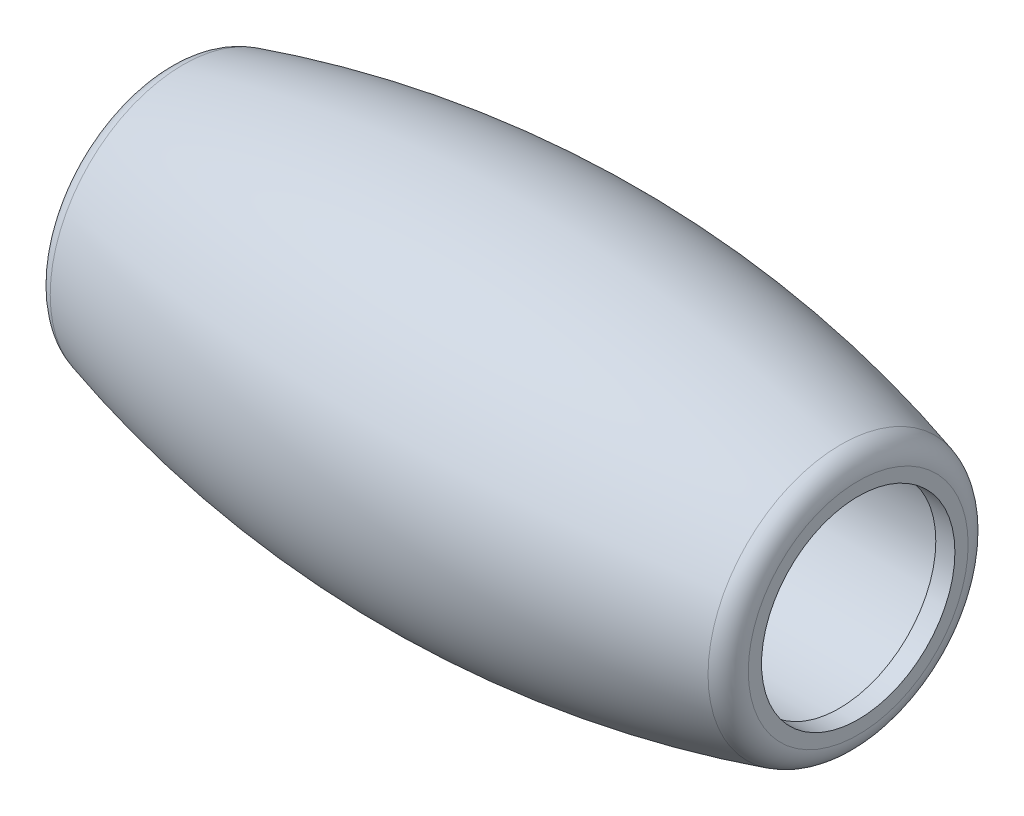
ISO-10303-21;
HEADER;
FILE_DESCRIPTION(('STEP AP214'),'2;1');
FILE_NAME('part.step','',(''),(''),'','','');
FILE_SCHEMA(('AUTOMOTIVE_DESIGN { 1 0 10303 214 1 1 1 1 }'));
ENDSEC;
DATA;
#1=APPLICATION_CONTEXT('core data for automotive mechanical design processes');
#2=APPLICATION_PROTOCOL_DEFINITION('international standard','automotive_design',2000,#1);
#3=PRODUCT_CONTEXT('',#1,'mechanical');
#4=PRODUCT('Part','Part','',(#3));
#5=PRODUCT_RELATED_PRODUCT_CATEGORY('part','',(#4));
#6=PRODUCT_DEFINITION_FORMATION('','',#4);
#7=PRODUCT_DEFINITION_CONTEXT('part definition',#1,'design');
#8=PRODUCT_DEFINITION('design','',#6,#7);
#9=PRODUCT_DEFINITION_SHAPE('','',#8);
#10=(LENGTH_UNIT() NAMED_UNIT(*) SI_UNIT(.MILLI.,.METRE.));
#11=(NAMED_UNIT(*) PLANE_ANGLE_UNIT() SI_UNIT($,.RADIAN.));
#12=(NAMED_UNIT(*) SI_UNIT($,.STERADIAN.) SOLID_ANGLE_UNIT());
#13=UNCERTAINTY_MEASURE_WITH_UNIT(LENGTH_MEASURE(1.E-05),#10,'distance_accuracy_value','');
#14=(GEOMETRIC_REPRESENTATION_CONTEXT(3) GLOBAL_UNCERTAINTY_ASSIGNED_CONTEXT((#13)) GLOBAL_UNIT_ASSIGNED_CONTEXT((#10,
#11,#12)) REPRESENTATION_CONTEXT('',''));
#15=CARTESIAN_POINT('',(0.,0.,0.));
#16=DIRECTION('',(0.,0.,1.));
#17=DIRECTION('',(1.,0.,0.));
#18=AXIS2_PLACEMENT_3D('',#15,#16,#17);
#19=CARTESIAN_POINT('',(14.5,0.,0.));
#20=DIRECTION('',(1.,0.,0.));
#21=DIRECTION('',(0.,0.,-1.));
#22=AXIS2_PLACEMENT_3D('',#19,#20,#21);
#23=PLANE('',#22);
#24=CARTESIAN_POINT('',(14.5,0.,0.));
#25=DIRECTION('',(1.,0.,0.));
#26=DIRECTION('',(0.,0.,-1.));
#27=AXIS2_PLACEMENT_3D('',#24,#25,#26);
#28=CIRCLE('',#27,4.60360920354194);
#29=CARTESIAN_POINT('',(14.5,0.,-4.60360920354195));
#30=VERTEX_POINT('',#29);
#31=EDGE_CURVE('E49',#30,#30,#28,.T.);
#32=ORIENTED_EDGE('',*,*,#31,.T.);
#33=EDGE_LOOP('',(#32));
#34=FACE_BOUND('',#33,.T.);
#35=CARTESIAN_POINT('',(14.5,0.,0.));
#36=DIRECTION('',(1.,0.,0.));
#37=DIRECTION('',(0.,0.,-1.));
#38=AXIS2_PLACEMENT_3D('',#35,#36,#37);
#39=CIRCLE('',#38,4.05);
#40=CARTESIAN_POINT('',(14.5,0.,-4.05));
#41=VERTEX_POINT('',#40);
#42=EDGE_CURVE('E69',#41,#41,#39,.T.);
#43=ORIENTED_EDGE('',*,*,#42,.F.);
#44=EDGE_LOOP('',(#43));
#45=FACE_BOUND('',#44,.T.);
#46=ADVANCED_FACE('F34',(#34,#45),#23,.T.);
#47=CARTESIAN_POINT('',(0.,0.,0.));
#48=DIRECTION('',(1.,0.,0.));
#49=DIRECTION('',(0.,0.,-1.));
#50=AXIS2_PLACEMENT_3D('',#47,#48,#49);
#51=DEGENERATE_TOROIDAL_SURFACE('',#50,42.5,50.,.F.);
#52=CARTESIAN_POINT('',(13.7755102040817,0.,0.));
#53=DIRECTION('',(-1.,0.,0.));
#54=DIRECTION('',(0.,0.,1.));
#55=AXIS2_PLACEMENT_3D('',#52,#53,#54);
#56=CIRCLE('',#55,5.564907350553);
#57=CARTESIAN_POINT('',(13.7755102040817,0.,5.56490735055299));
#58=VERTEX_POINT('',#57);
#59=EDGE_CURVE('E41',#58,#58,#56,.T.);
#60=ORIENTED_EDGE('',*,*,#59,.T.);
#61=EDGE_LOOP('',(#60));
#62=FACE_BOUND('',#61,.T.);
#63=CARTESIAN_POINT('',(-13.7755102040816,0.,0.));
#64=DIRECTION('',(1.,0.,0.));
#65=DIRECTION('',(0.,0.,-1.));
#66=AXIS2_PLACEMENT_3D('',#63,#64,#65);
#67=CIRCLE('',#66,5.564907350553);
#68=CARTESIAN_POINT('',(-13.7755102040816,0.,-5.56490735055299));
#69=VERTEX_POINT('',#68);
#70=EDGE_CURVE('E45',#69,#69,#67,.T.);
#71=ORIENTED_EDGE('',*,*,#70,.T.);
#72=EDGE_LOOP('',(#71));
#73=FACE_BOUND('',#72,.T.);
#74=ADVANCED_FACE('F77',(#62,#73),#51,.F.);
#75=CARTESIAN_POINT('',(-14.5,0.,0.));
#76=DIRECTION('',(-1.,0.,0.));
#77=DIRECTION('',(0.,0.,1.));
#78=AXIS2_PLACEMENT_3D('',#75,#76,#77);
#79=PLANE('',#78);
#80=CARTESIAN_POINT('',(-14.5,0.,0.));
#81=DIRECTION('',(-1.,0.,0.));
#82=DIRECTION('',(0.,0.,1.));
#83=AXIS2_PLACEMENT_3D('',#80,#81,#82);
#84=CIRCLE('',#83,4.60360920354193);
#85=CARTESIAN_POINT('',(-14.5,0.,4.60360920354194));
#86=VERTEX_POINT('',#85);
#87=EDGE_CURVE('E10',#86,#86,#84,.T.);
#88=ORIENTED_EDGE('',*,*,#87,.T.);
#89=EDGE_LOOP('',(#88));
#90=FACE_BOUND('',#89,.T.);
#91=CARTESIAN_POINT('',(-14.5,0.,0.));
#92=DIRECTION('',(1.,0.,0.));
#93=DIRECTION('',(0.,0.,-1.));
#94=AXIS2_PLACEMENT_3D('',#91,#92,#93);
#95=CIRCLE('',#94,4.05);
#96=CARTESIAN_POINT('',(-14.5,0.,-4.05));
#97=VERTEX_POINT('',#96);
#98=EDGE_CURVE('E54',#97,#97,#95,.T.);
#99=ORIENTED_EDGE('',*,*,#98,.T.);
#100=EDGE_LOOP('',(#99));
#101=FACE_BOUND('',#100,.T.);
#102=ADVANCED_FACE('F83',(#90,#101),#79,.T.);
#103=CARTESIAN_POINT('',(15.,0.,0.));
#104=DIRECTION('',(1.,0.,0.));
#105=DIRECTION('',(0.,0.,-1.));
#106=AXIS2_PLACEMENT_3D('',#103,#104,#105);
#107=CYLINDRICAL_SURFACE('',#106,4.05);
#108=CARTESIAN_POINT('',(-13.7,0.,0.));
#109=DIRECTION('',(1.,0.,0.));
#110=DIRECTION('',(0.,0.,-1.));
#111=AXIS2_PLACEMENT_3D('',#108,#109,#110);
#112=CIRCLE('',#111,4.05);
#113=CARTESIAN_POINT('',(-13.7,0.,-4.05));
#114=VERTEX_POINT('',#113);
#115=EDGE_CURVE('E57',#114,#114,#112,.T.);
#116=ORIENTED_EDGE('',*,*,#115,.T.);
#117=EDGE_LOOP('',(#116));
#118=FACE_BOUND('',#117,.T.);
#119=ORIENTED_EDGE('',*,*,#98,.F.);
#120=EDGE_LOOP('',(#119));
#121=FACE_BOUND('',#120,.T.);
#122=ADVANCED_FACE('F111',(#118,#121),#107,.F.);
#123=CARTESIAN_POINT('',(-13.7,0.,0.));
#124=DIRECTION('',(1.,0.,0.));
#125=DIRECTION('',(0.,0.,-1.));
#126=AXIS2_PLACEMENT_3D('',#123,#124,#125);
#127=PLANE('',#126);
#128=CARTESIAN_POINT('',(-13.7,0.,0.));
#129=DIRECTION('',(1.,0.,0.));
#130=DIRECTION('',(0.,0.,-1.));
#131=AXIS2_PLACEMENT_3D('',#128,#129,#130);
#132=CIRCLE('',#131,4.5);
#133=CARTESIAN_POINT('',(-13.7,0.,-4.5));
#134=VERTEX_POINT('',#133);
#135=EDGE_CURVE('E60',#134,#134,#132,.T.);
#136=ORIENTED_EDGE('',*,*,#135,.T.);
#137=EDGE_LOOP('',(#136));
#138=FACE_BOUND('',#137,.T.);
#139=ORIENTED_EDGE('',*,*,#115,.F.);
#140=EDGE_LOOP('',(#139));
#141=FACE_BOUND('',#140,.T.);
#142=ADVANCED_FACE('F107',(#138,#141),#127,.T.);
#143=CARTESIAN_POINT('',(15.,0.,0.));
#144=DIRECTION('',(1.,0.,0.));
#145=DIRECTION('',(0.,0.,-1.));
#146=AXIS2_PLACEMENT_3D('',#143,#144,#145);
#147=CYLINDRICAL_SURFACE('',#146,4.5);
#148=CARTESIAN_POINT('',(13.7,0.,0.));
#149=DIRECTION('',(1.,0.,0.));
#150=DIRECTION('',(0.,0.,-1.));
#151=AXIS2_PLACEMENT_3D('',#148,#149,#150);
#152=CIRCLE('',#151,4.5);
#153=CARTESIAN_POINT('',(13.7,0.,-4.5));
#154=VERTEX_POINT('',#153);
#155=EDGE_CURVE('E63',#154,#154,#152,.T.);
#156=ORIENTED_EDGE('',*,*,#155,.T.);
#157=EDGE_LOOP('',(#156));
#158=FACE_BOUND('',#157,.T.);
#159=ORIENTED_EDGE('',*,*,#135,.F.);
#160=EDGE_LOOP('',(#159));
#161=FACE_BOUND('',#160,.T.);
#162=ADVANCED_FACE('F101',(#158,#161),#147,.F.);
#163=CARTESIAN_POINT('',(13.7,0.,0.));
#164=DIRECTION('',(-1.,0.,0.));
#165=DIRECTION('',(0.,0.,1.));
#166=AXIS2_PLACEMENT_3D('',#163,#164,#165);
#167=PLANE('',#166);
#168=CARTESIAN_POINT('',(13.7,0.,0.));
#169=DIRECTION('',(1.,0.,0.));
#170=DIRECTION('',(0.,0.,-1.));
#171=AXIS2_PLACEMENT_3D('',#168,#169,#170);
#172=CIRCLE('',#171,4.05);
#173=CARTESIAN_POINT('',(13.7,0.,-4.05));
#174=VERTEX_POINT('',#173);
#175=EDGE_CURVE('E66',#174,#174,#172,.T.);
#176=ORIENTED_EDGE('',*,*,#175,.T.);
#177=EDGE_LOOP('',(#176));
#178=FACE_BOUND('',#177,.T.);
#179=ORIENTED_EDGE('',*,*,#155,.F.);
#180=EDGE_LOOP('',(#179));
#181=FACE_BOUND('',#180,.T.);
#182=ADVANCED_FACE('F94',(#178,#181),#167,.T.);
#183=CARTESIAN_POINT('',(15.,0.,0.));
#184=DIRECTION('',(1.,0.,0.));
#185=DIRECTION('',(0.,0.,-1.));
#186=AXIS2_PLACEMENT_3D('',#183,#184,#185);
#187=CYLINDRICAL_SURFACE('',#186,4.05);
#188=ORIENTED_EDGE('',*,*,#42,.T.);
#189=EDGE_LOOP('',(#188));
#190=FACE_BOUND('',#189,.T.);
#191=ORIENTED_EDGE('',*,*,#175,.F.);
#192=EDGE_LOOP('',(#191));
#193=FACE_BOUND('',#192,.T.);
#194=ADVANCED_FACE('F73',(#190,#193),#187,.F.);
#195=CARTESIAN_POINT('',(13.5,0.,0.));
#196=DIRECTION('',(1.,0.,0.));
#197=DIRECTION('',(0.,0.,-1.));
#198=AXIS2_PLACEMENT_3D('',#195,#196,#197);
#199=TOROIDAL_SURFACE('',#198,4.60360920354194,1.);
#200=ORIENTED_EDGE('',*,*,#59,.F.);
#201=EDGE_LOOP('',(#200));
#202=FACE_BOUND('',#201,.T.);
#203=ORIENTED_EDGE('',*,*,#31,.F.);
#204=EDGE_LOOP('',(#203));
#205=FACE_BOUND('',#204,.T.);
#206=ADVANCED_FACE('F86',(#202,#205),#199,.T.);
#207=CARTESIAN_POINT('',(-13.5,0.,0.));
#208=DIRECTION('',(-1.,0.,0.));
#209=DIRECTION('',(0.,0.,1.));
#210=AXIS2_PLACEMENT_3D('',#207,#208,#209);
#211=TOROIDAL_SURFACE('',#210,4.60360920354193,1.);
#212=ORIENTED_EDGE('',*,*,#87,.F.);
#213=EDGE_LOOP('',(#212));
#214=FACE_BOUND('',#213,.T.);
#215=ORIENTED_EDGE('',*,*,#70,.F.);
#216=EDGE_LOOP('',(#215));
#217=FACE_BOUND('',#216,.T.);
#218=ADVANCED_FACE('F36',(#214,#217),#211,.T.);
#219=CLOSED_SHELL('',(#46,#74,#102,#122,#142,#162,#182,#194,#206,#218));
#220=MANIFOLD_SOLID_BREP('B2',#219);
#221=ADVANCED_BREP_SHAPE_REPRESENTATION('',(#18,#220),#14);
#222=SHAPE_DEFINITION_REPRESENTATION(#9,#221);
ENDSEC;
END-ISO-10303-21;
